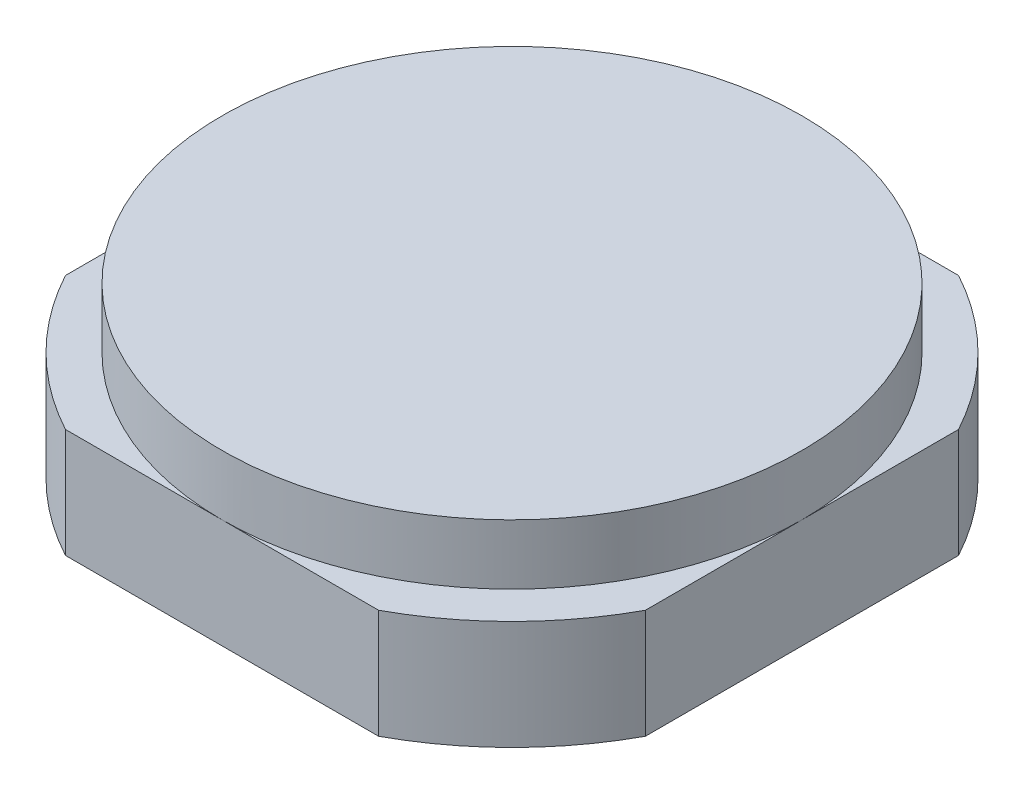
ISO-10303-21;
HEADER;
FILE_DESCRIPTION(('STEP AP214'),'2;1');
FILE_NAME('part.step','',(''),(''),'','','');
FILE_SCHEMA(('AUTOMOTIVE_DESIGN { 1 0 10303 214 1 1 1 1 }'));
ENDSEC;
DATA;
#1=APPLICATION_CONTEXT('core data for automotive mechanical design processes');
#2=APPLICATION_PROTOCOL_DEFINITION('international standard','automotive_design',2000,#1);
#3=PRODUCT_CONTEXT('',#1,'mechanical');
#4=PRODUCT('Part','Part','',(#3));
#5=PRODUCT_RELATED_PRODUCT_CATEGORY('part','',(#4));
#6=PRODUCT_DEFINITION_FORMATION('','',#4);
#7=PRODUCT_DEFINITION_CONTEXT('part definition',#1,'design');
#8=PRODUCT_DEFINITION('design','',#6,#7);
#9=PRODUCT_DEFINITION_SHAPE('','',#8);
#10=(LENGTH_UNIT() NAMED_UNIT(*) SI_UNIT(.MILLI.,.METRE.));
#11=(NAMED_UNIT(*) PLANE_ANGLE_UNIT() SI_UNIT($,.RADIAN.));
#12=(NAMED_UNIT(*) SI_UNIT($,.STERADIAN.) SOLID_ANGLE_UNIT());
#13=UNCERTAINTY_MEASURE_WITH_UNIT(LENGTH_MEASURE(1.E-05),#10,'distance_accuracy_value','');
#14=(GEOMETRIC_REPRESENTATION_CONTEXT(3) GLOBAL_UNCERTAINTY_ASSIGNED_CONTEXT((#13)) GLOBAL_UNIT_ASSIGNED_CONTEXT((#10,
#11,#12)) REPRESENTATION_CONTEXT('',''));
#15=CARTESIAN_POINT('',(0.,0.,0.));
#16=DIRECTION('',(0.,0.,1.));
#17=DIRECTION('',(1.,0.,0.));
#18=AXIS2_PLACEMENT_3D('',#15,#16,#17);
#19=CARTESIAN_POINT('',(0.,80.,0.));
#20=DIRECTION('',(0.,-1.,0.));
#21=DIRECTION('',(0.,0.,-1.));
#22=AXIS2_PLACEMENT_3D('',#19,#20,#21);
#23=CYLINDRICAL_SURFACE('',#22,241.5);
#24=DIRECTION('',(0.,-1.,0.));
#25=VECTOR('',#24,1.);
#26=CARTESIAN_POINT('',(-114.743191519149,80.,212.5));
#27=LINE('',#26,#25);
#28=CARTESIAN_POINT('',(-114.743191519149,80.,212.5));
#29=VERTEX_POINT('',#28);
#30=CARTESIAN_POINT('',(-114.743191519149,0.,212.5));
#31=VERTEX_POINT('',#30);
#32=EDGE_CURVE('E41',#29,#31,#27,.T.);
#33=ORIENTED_EDGE('',*,*,#32,.F.);
#34=CARTESIAN_POINT('',(0.,80.,0.));
#35=DIRECTION('',(0.,1.,0.));
#36=DIRECTION('',(1.,0.,0.));
#37=AXIS2_PLACEMENT_3D('',#34,#35,#36);
#38=CIRCLE('',#37,241.5);
#39=CARTESIAN_POINT('',(-212.5,80.,114.743191519149));
#40=VERTEX_POINT('',#39);
#41=EDGE_CURVE('E125',#40,#29,#38,.T.);
#42=ORIENTED_EDGE('',*,*,#41,.F.);
#43=DIRECTION('',(0.,-1.,0.));
#44=VECTOR('',#43,1.);
#45=CARTESIAN_POINT('',(-212.5,80.,114.743191519149));
#46=LINE('',#45,#44);
#47=CARTESIAN_POINT('',(-212.5,0.,114.743191519149));
#48=VERTEX_POINT('',#47);
#49=EDGE_CURVE('E159',#48,#40,#46,.F.);
#50=ORIENTED_EDGE('',*,*,#49,.F.);
#51=CARTESIAN_POINT('',(0.,0.,0.));
#52=DIRECTION('',(0.,1.,0.));
#53=DIRECTION('',(1.,0.,0.));
#54=AXIS2_PLACEMENT_3D('',#51,#52,#53);
#55=CIRCLE('',#54,241.5);
#56=EDGE_CURVE('E140',#48,#31,#55,.T.);
#57=ORIENTED_EDGE('',*,*,#56,.T.);
#58=EDGE_LOOP('',(#33,#42,#50,#57));
#59=FACE_BOUND('',#58,.T.);
#60=ADVANCED_FACE('F17',(#59),#23,.T.);
#61=DIRECTION('',(0.,-1.,0.));
#62=VECTOR('',#61,1.);
#63=CARTESIAN_POINT('',(114.743191519149,80.,212.5));
#64=LINE('',#63,#62);
#65=CARTESIAN_POINT('',(114.743191519149,0.,212.5));
#66=VERTEX_POINT('',#65);
#67=CARTESIAN_POINT('',(114.743191519149,80.,212.5));
#68=VERTEX_POINT('',#67);
#69=EDGE_CURVE('E153',#66,#68,#64,.F.);
#70=ORIENTED_EDGE('',*,*,#69,.F.);
#71=CARTESIAN_POINT('',(212.5,0.,114.743191519148));
#72=VERTEX_POINT('',#71);
#73=EDGE_CURVE('E135',#66,#72,#55,.T.);
#74=ORIENTED_EDGE('',*,*,#73,.T.);
#75=DIRECTION('',(0.,-1.,0.));
#76=VECTOR('',#75,1.);
#77=CARTESIAN_POINT('',(212.5,80.,114.743191519148));
#78=LINE('',#77,#76);
#79=CARTESIAN_POINT('',(212.5,80.,114.743191519148));
#80=VERTEX_POINT('',#79);
#81=EDGE_CURVE('E33',#80,#72,#78,.T.);
#82=ORIENTED_EDGE('',*,*,#81,.F.);
#83=EDGE_CURVE('E120',#68,#80,#38,.T.);
#84=ORIENTED_EDGE('',*,*,#83,.F.);
#85=EDGE_LOOP('',(#70,#74,#82,#84));
#86=FACE_BOUND('',#85,.T.);
#87=ADVANCED_FACE('F221',(#86),#23,.T.);
#88=DIRECTION('',(0.,-1.,0.));
#89=VECTOR('',#88,1.);
#90=CARTESIAN_POINT('',(-212.5,80.,-114.743191519149));
#91=LINE('',#90,#89);
#92=CARTESIAN_POINT('',(-212.5,80.,-114.743191519149));
#93=VERTEX_POINT('',#92);
#94=CARTESIAN_POINT('',(-212.5,0.,-114.743191519149));
#95=VERTEX_POINT('',#94);
#96=EDGE_CURVE('E157',#93,#95,#91,.T.);
#97=ORIENTED_EDGE('',*,*,#96,.F.);
#98=CARTESIAN_POINT('',(-114.743191519149,80.,-212.5));
#99=VERTEX_POINT('',#98);
#100=EDGE_CURVE('E118',#99,#93,#38,.T.);
#101=ORIENTED_EDGE('',*,*,#100,.F.);
#102=DIRECTION('',(0.,-1.,0.));
#103=VECTOR('',#102,1.);
#104=CARTESIAN_POINT('',(-114.743191519149,80.,-212.5));
#105=LINE('',#104,#103);
#106=CARTESIAN_POINT('',(-114.743191519149,0.,-212.5));
#107=VERTEX_POINT('',#106);
#108=EDGE_CURVE('E162',#107,#99,#105,.F.);
#109=ORIENTED_EDGE('',*,*,#108,.F.);
#110=EDGE_CURVE('E134',#107,#95,#55,.T.);
#111=ORIENTED_EDGE('',*,*,#110,.T.);
#112=EDGE_LOOP('',(#97,#101,#109,#111));
#113=FACE_BOUND('',#112,.T.);
#114=ADVANCED_FACE('F188',(#113),#23,.T.);
#115=DIRECTION('',(0.,-1.,0.));
#116=VECTOR('',#115,1.);
#117=CARTESIAN_POINT('',(114.743191519149,80.,-212.5));
#118=LINE('',#117,#116);
#119=CARTESIAN_POINT('',(114.743191519149,80.,-212.5));
#120=VERTEX_POINT('',#119);
#121=CARTESIAN_POINT('',(114.743191519149,0.,-212.5));
#122=VERTEX_POINT('',#121);
#123=EDGE_CURVE('E117',#120,#122,#118,.T.);
#124=ORIENTED_EDGE('',*,*,#123,.F.);
#125=CARTESIAN_POINT('',(212.5,80.,-114.743191519148));
#126=VERTEX_POINT('',#125);
#127=EDGE_CURVE('E110',#126,#120,#38,.T.);
#128=ORIENTED_EDGE('',*,*,#127,.F.);
#129=DIRECTION('',(0.,-1.,0.));
#130=VECTOR('',#129,1.);
#131=CARTESIAN_POINT('',(212.5,80.,-114.743191519148));
#132=LINE('',#131,#130);
#133=CARTESIAN_POINT('',(212.5,0.,-114.743191519148));
#134=VERTEX_POINT('',#133);
#135=EDGE_CURVE('E93',#134,#126,#132,.F.);
#136=ORIENTED_EDGE('',*,*,#135,.F.);
#137=EDGE_CURVE('E128',#134,#122,#55,.T.);
#138=ORIENTED_EDGE('',*,*,#137,.T.);
#139=EDGE_LOOP('',(#124,#128,#136,#138));
#140=FACE_BOUND('',#139,.T.);
#141=ADVANCED_FACE('F116',(#140),#23,.T.);
#142=CARTESIAN_POINT('',(0.,80.,0.));
#143=DIRECTION('',(0.,1.,0.));
#144=DIRECTION('',(0.,0.,1.));
#145=AXIS2_PLACEMENT_3D('',#142,#143,#144);
#146=PLANE('',#145);
#147=ORIENTED_EDGE('',*,*,#41,.T.);
#148=DIRECTION('',(-1.,0.,0.));
#149=VECTOR('',#148,1.);
#150=CARTESIAN_POINT('',(-212.5,80.,212.5));
#151=LINE('',#150,#149);
#152=CARTESIAN_POINT('',(0.,80.,212.5));
#153=VERTEX_POINT('',#152);
#154=EDGE_CURVE('E165',#153,#29,#151,.T.);
#155=ORIENTED_EDGE('',*,*,#154,.F.);
#156=CARTESIAN_POINT('',(0.,80.,0.));
#157=DIRECTION('',(0.,1.,0.));
#158=DIRECTION('',(0.,0.,1.));
#159=AXIS2_PLACEMENT_3D('',#156,#157,#158);
#160=CIRCLE('',#159,212.5);
#161=CARTESIAN_POINT('',(-212.5,80.,0.));
#162=VERTEX_POINT('',#161);
#163=EDGE_CURVE('E26',#162,#153,#160,.T.);
#164=ORIENTED_EDGE('',*,*,#163,.F.);
#165=DIRECTION('',(0.,0.,-1.));
#166=VECTOR('',#165,1.);
#167=CARTESIAN_POINT('',(-212.5,80.,-212.5));
#168=LINE('',#167,#166);
#169=EDGE_CURVE('E167',#40,#162,#168,.T.);
#170=ORIENTED_EDGE('',*,*,#169,.F.);
#171=EDGE_LOOP('',(#147,#155,#164,#170));
#172=FACE_BOUND('',#171,.T.);
#173=ADVANCED_FACE('F200',(#172),#146,.T.);
#174=CARTESIAN_POINT('',(212.5,80.,0.));
#175=VERTEX_POINT('',#174);
#176=EDGE_CURVE('E11',#153,#175,#160,.T.);
#177=ORIENTED_EDGE('',*,*,#176,.F.);
#178=EDGE_CURVE('E103',#68,#153,#151,.T.);
#179=ORIENTED_EDGE('',*,*,#178,.F.);
#180=ORIENTED_EDGE('',*,*,#83,.T.);
#181=DIRECTION('',(0.,0.,1.));
#182=VECTOR('',#181,1.);
#183=CARTESIAN_POINT('',(212.5,80.,212.5));
#184=LINE('',#183,#182);
#185=EDGE_CURVE('E113',#175,#80,#184,.T.);
#186=ORIENTED_EDGE('',*,*,#185,.F.);
#187=EDGE_LOOP('',(#177,#179,#180,#186));
#188=FACE_BOUND('',#187,.T.);
#189=ADVANCED_FACE('F220',(#188),#146,.T.);
#190=ORIENTED_EDGE('',*,*,#100,.T.);
#191=EDGE_CURVE('E168',#162,#93,#168,.T.);
#192=ORIENTED_EDGE('',*,*,#191,.F.);
#193=CARTESIAN_POINT('',(0.,80.,-212.5));
#194=VERTEX_POINT('',#193);
#195=EDGE_CURVE('E123',#194,#162,#160,.T.);
#196=ORIENTED_EDGE('',*,*,#195,.F.);
#197=DIRECTION('',(1.,0.,0.));
#198=VECTOR('',#197,1.);
#199=CARTESIAN_POINT('',(212.5,80.,-212.5));
#200=LINE('',#199,#198);
#201=EDGE_CURVE('E170',#99,#194,#200,.T.);
#202=ORIENTED_EDGE('',*,*,#201,.F.);
#203=EDGE_LOOP('',(#190,#192,#196,#202));
#204=FACE_BOUND('',#203,.T.);
#205=ADVANCED_FACE('F206',(#204),#146,.T.);
#206=ORIENTED_EDGE('',*,*,#127,.T.);
#207=EDGE_CURVE('E112',#194,#120,#200,.T.);
#208=ORIENTED_EDGE('',*,*,#207,.F.);
#209=EDGE_CURVE('E25',#175,#194,#160,.T.);
#210=ORIENTED_EDGE('',*,*,#209,.F.);
#211=EDGE_CURVE('E96',#126,#175,#184,.T.);
#212=ORIENTED_EDGE('',*,*,#211,.F.);
#213=EDGE_LOOP('',(#206,#208,#210,#212));
#214=FACE_BOUND('',#213,.T.);
#215=ADVANCED_FACE('F108',(#214),#146,.T.);
#216=CARTESIAN_POINT('',(0.,0.,0.));
#217=DIRECTION('',(0.,1.,0.));
#218=DIRECTION('',(0.,0.,1.));
#219=AXIS2_PLACEMENT_3D('',#216,#217,#218);
#220=PLANE('',#219);
#221=DIRECTION('',(1.,0.,0.));
#222=VECTOR('',#221,1.);
#223=CARTESIAN_POINT('',(-212.5,0.,212.5));
#224=LINE('',#223,#222);
#225=EDGE_CURVE('E172',#31,#66,#224,.T.);
#226=ORIENTED_EDGE('',*,*,#225,.F.);
#227=ORIENTED_EDGE('',*,*,#56,.F.);
#228=DIRECTION('',(0.,0.,1.));
#229=VECTOR('',#228,1.);
#230=CARTESIAN_POINT('',(-212.5,0.,-212.5));
#231=LINE('',#230,#229);
#232=EDGE_CURVE('E174',#95,#48,#231,.T.);
#233=ORIENTED_EDGE('',*,*,#232,.F.);
#234=ORIENTED_EDGE('',*,*,#110,.F.);
#235=DIRECTION('',(-1.,0.,0.));
#236=VECTOR('',#235,1.);
#237=CARTESIAN_POINT('',(212.5,0.,-212.5));
#238=LINE('',#237,#236);
#239=EDGE_CURVE('E176',#122,#107,#238,.T.);
#240=ORIENTED_EDGE('',*,*,#239,.F.);
#241=ORIENTED_EDGE('',*,*,#137,.F.);
#242=DIRECTION('',(0.,0.,-1.));
#243=VECTOR('',#242,1.);
#244=CARTESIAN_POINT('',(212.5,0.,212.5));
#245=LINE('',#244,#243);
#246=EDGE_CURVE('E98',#72,#134,#245,.T.);
#247=ORIENTED_EDGE('',*,*,#246,.F.);
#248=ORIENTED_EDGE('',*,*,#73,.F.);
#249=EDGE_LOOP('',(#226,#227,#233,#234,#240,#241,#247,#248));
#250=FACE_BOUND('',#249,.T.);
#251=ADVANCED_FACE('F190',(#250),#220,.F.);
#252=CARTESIAN_POINT('',(0.,124.,0.));
#253=DIRECTION('',(0.,-1.,0.));
#254=DIRECTION('',(0.,0.,-1.));
#255=AXIS2_PLACEMENT_3D('',#252,#253,#254);
#256=CYLINDRICAL_SURFACE('',#255,212.5);
#257=CARTESIAN_POINT('',(0.,124.,0.));
#258=DIRECTION('',(0.,-1.,0.));
#259=DIRECTION('',(0.,0.,-1.));
#260=AXIS2_PLACEMENT_3D('',#257,#258,#259);
#261=CIRCLE('',#260,212.5);
#262=CARTESIAN_POINT('',(0.,124.,-212.5));
#263=VERTEX_POINT('',#262);
#264=EDGE_CURVE('E143',#263,#263,#261,.T.);
#265=ORIENTED_EDGE('',*,*,#264,.T.);
#266=EDGE_LOOP('',(#265));
#267=FACE_BOUND('',#266,.T.);
#268=ORIENTED_EDGE('',*,*,#176,.T.);
#269=ORIENTED_EDGE('',*,*,#209,.T.);
#270=ORIENTED_EDGE('',*,*,#195,.T.);
#271=ORIENTED_EDGE('',*,*,#163,.T.);
#272=EDGE_LOOP('',(#268,#269,#270,#271));
#273=FACE_BOUND('',#272,.T.);
#274=ADVANCED_FACE('F209',(#267,#273),#256,.T.);
#275=CARTESIAN_POINT('',(0.,124.,0.));
#276=DIRECTION('',(0.,-1.,0.));
#277=DIRECTION('',(0.,0.,-1.));
#278=AXIS2_PLACEMENT_3D('',#275,#276,#277);
#279=PLANE('',#278);
#280=ORIENTED_EDGE('',*,*,#264,.F.);
#281=EDGE_LOOP('',(#280));
#282=FACE_BOUND('',#281,.T.);
#283=ADVANCED_FACE('F340',(#282),#279,.F.);
#284=CARTESIAN_POINT('',(212.5,-694.434248972177,212.5));
#285=DIRECTION('',(1.,0.,0.));
#286=DIRECTION('',(0.,0.,-1.));
#287=AXIS2_PLACEMENT_3D('',#284,#285,#286);
#288=PLANE('',#287);
#289=ORIENTED_EDGE('',*,*,#81,.T.);
#290=ORIENTED_EDGE('',*,*,#246,.T.);
#291=ORIENTED_EDGE('',*,*,#135,.T.);
#292=ORIENTED_EDGE('',*,*,#211,.T.);
#293=ORIENTED_EDGE('',*,*,#185,.T.);
#294=EDGE_LOOP('',(#289,#290,#291,#292,#293));
#295=FACE_BOUND('',#294,.T.);
#296=ADVANCED_FACE('F95',(#295),#288,.T.);
#297=CARTESIAN_POINT('',(212.5,-694.434248972177,-212.5));
#298=DIRECTION('',(0.,0.,-1.));
#299=DIRECTION('',(-1.,0.,0.));
#300=AXIS2_PLACEMENT_3D('',#297,#298,#299);
#301=PLANE('',#300);
#302=ORIENTED_EDGE('',*,*,#123,.T.);
#303=ORIENTED_EDGE('',*,*,#239,.T.);
#304=ORIENTED_EDGE('',*,*,#108,.T.);
#305=ORIENTED_EDGE('',*,*,#201,.T.);
#306=ORIENTED_EDGE('',*,*,#207,.T.);
#307=EDGE_LOOP('',(#302,#303,#304,#305,#306));
#308=FACE_BOUND('',#307,.T.);
#309=ADVANCED_FACE('F181',(#308),#301,.T.);
#310=CARTESIAN_POINT('',(-212.5,-694.434248972177,-212.5));
#311=DIRECTION('',(-1.,0.,0.));
#312=DIRECTION('',(0.,0.,1.));
#313=AXIS2_PLACEMENT_3D('',#310,#311,#312);
#314=PLANE('',#313);
#315=ORIENTED_EDGE('',*,*,#96,.T.);
#316=ORIENTED_EDGE('',*,*,#232,.T.);
#317=ORIENTED_EDGE('',*,*,#49,.T.);
#318=ORIENTED_EDGE('',*,*,#169,.T.);
#319=ORIENTED_EDGE('',*,*,#191,.T.);
#320=EDGE_LOOP('',(#315,#316,#317,#318,#319));
#321=FACE_BOUND('',#320,.T.);
#322=ADVANCED_FACE('F194',(#321),#314,.T.);
#323=CARTESIAN_POINT('',(-212.5,-694.434248972177,212.5));
#324=DIRECTION('',(0.,0.,1.));
#325=DIRECTION('',(1.,0.,0.));
#326=AXIS2_PLACEMENT_3D('',#323,#324,#325);
#327=PLANE('',#326);
#328=ORIENTED_EDGE('',*,*,#32,.T.);
#329=ORIENTED_EDGE('',*,*,#225,.T.);
#330=ORIENTED_EDGE('',*,*,#69,.T.);
#331=ORIENTED_EDGE('',*,*,#178,.T.);
#332=ORIENTED_EDGE('',*,*,#154,.T.);
#333=EDGE_LOOP('',(#328,#329,#330,#331,#332));
#334=FACE_BOUND('',#333,.T.);
#335=ADVANCED_FACE('F222',(#334),#327,.T.);
#336=CLOSED_SHELL('',(#60,#87,#114,#141,#173,#189,#205,#215,#251,#274,#283,#296,#309,#322,#335));
#337=MANIFOLD_SOLID_BREP('B1',#336);
#338=ADVANCED_BREP_SHAPE_REPRESENTATION('',(#18,#337),#14);
#339=SHAPE_DEFINITION_REPRESENTATION(#9,#338);
ENDSEC;
END-ISO-10303-21;
